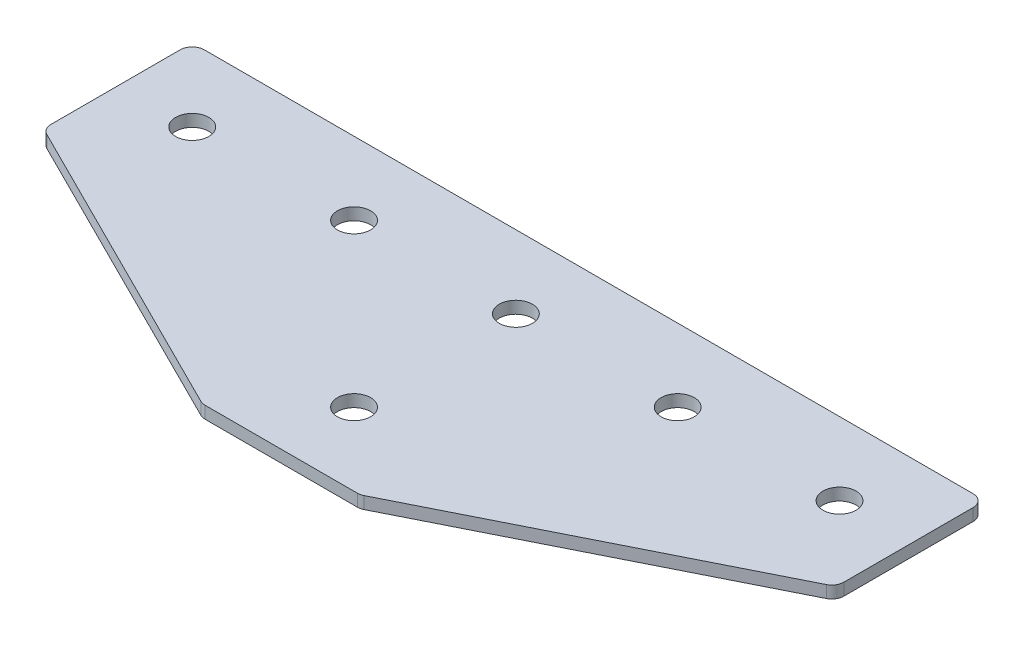
ISO-10303-21;
HEADER;
FILE_DESCRIPTION(('STEP AP214'),'2;1');
FILE_NAME('part.step','',(''),(''),'','','');
FILE_SCHEMA(('AUTOMOTIVE_DESIGN { 1 0 10303 214 1 1 1 1 }'));
ENDSEC;
DATA;
#1=APPLICATION_CONTEXT('core data for automotive mechanical design processes');
#2=APPLICATION_PROTOCOL_DEFINITION('international standard','automotive_design',2000,#1);
#3=PRODUCT_CONTEXT('',#1,'mechanical');
#4=PRODUCT('Part','Part','',(#3));
#5=PRODUCT_RELATED_PRODUCT_CATEGORY('part','',(#4));
#6=PRODUCT_DEFINITION_FORMATION('','',#4);
#7=PRODUCT_DEFINITION_CONTEXT('part definition',#1,'design');
#8=PRODUCT_DEFINITION('design','',#6,#7);
#9=PRODUCT_DEFINITION_SHAPE('','',#8);
#10=(LENGTH_UNIT() NAMED_UNIT(*) SI_UNIT(.MILLI.,.METRE.));
#11=(NAMED_UNIT(*) PLANE_ANGLE_UNIT() SI_UNIT($,.RADIAN.));
#12=(NAMED_UNIT(*) SI_UNIT($,.STERADIAN.) SOLID_ANGLE_UNIT());
#13=UNCERTAINTY_MEASURE_WITH_UNIT(LENGTH_MEASURE(1.E-05),#10,'distance_accuracy_value','');
#14=(GEOMETRIC_REPRESENTATION_CONTEXT(3) GLOBAL_UNCERTAINTY_ASSIGNED_CONTEXT((#13)) GLOBAL_UNIT_ASSIGNED_CONTEXT((#10,
#11,#12)) REPRESENTATION_CONTEXT('',''));
#15=CARTESIAN_POINT('',(0.,0.,0.));
#16=DIRECTION('',(0.,0.,1.));
#17=DIRECTION('',(1.,0.,0.));
#18=AXIS2_PLACEMENT_3D('',#15,#16,#17);
#19=CARTESIAN_POINT('',(-1.37420990733972,1.42462627720624,-21.5499410746997));
#20=DIRECTION('',(0.,-1.,0.));
#21=DIRECTION('',(0.,0.,-1.));
#22=AXIS2_PLACEMENT_3D('',#19,#20,#21);
#23=PLANE('',#22);
#24=CARTESIAN_POINT('',(-1.37420990733972,1.42462627720624,-21.5499410746997));
#25=DIRECTION('',(0.,1.,0.));
#26=DIRECTION('',(0.,0.,1.));
#27=AXIS2_PLACEMENT_3D('',#24,#25,#26);
#28=CIRCLE('',#27,4.1);
#29=CARTESIAN_POINT('',(-1.37420990733972,1.42462627720624,-17.4499410746997));
#30=VERTEX_POINT('',#29);
#31=EDGE_CURVE('E119',#30,#30,#28,.T.);
#32=ORIENTED_EDGE('',*,*,#31,.T.);
#33=EDGE_LOOP('',(#32));
#34=FACE_BOUND('',#33,.T.);
#35=DIRECTION('',(1.,0.,0.));
#36=VECTOR('',#35,1.);
#37=CARTESIAN_POINT('',(-19.3742099073397,1.42462627720624,36.4500589253003));
#38=LINE('',#37,#36);
#39=CARTESIAN_POINT('',(-20.1938700198407,1.42462627720624,36.4500589253003));
#40=VERTEX_POINT('',#39);
#41=CARTESIAN_POINT('',(17.4454502051613,1.42462627720624,36.4500589253003));
#42=VERTEX_POINT('',#41);
#43=EDGE_CURVE('E164',#40,#42,#38,.T.);
#44=ORIENTED_EDGE('',*,*,#43,.F.);
#45=CARTESIAN_POINT('',(-20.1938700198407,1.42462627720624,33.4500589253003));
#46=DIRECTION('',(0.,1.,0.));
#47=DIRECTION('',(0.,0.,-1.));
#48=AXIS2_PLACEMENT_3D('',#45,#46,#47);
#49=CIRCLE('',#48,3.);
#50=CARTESIAN_POINT('',(-21.5355108063406,1.42462627720624,36.1333404983));
#51=VERTEX_POINT('',#50);
#52=EDGE_CURVE('E221',#51,#40,#49,.T.);
#53=ORIENTED_EDGE('',*,*,#52,.F.);
#54=DIRECTION('',(-0.894427190999916,0.,-0.447213595499958));
#55=VECTOR('',#54,1.);
#56=CARTESIAN_POINT('',(-20.9020739523401,1.42462627720624,36.4500589253003));
#57=LINE('',#56,#55);
#58=CARTESIAN_POINT('',(-97.7158506938396,1.42462627720624,-1.95682944544947));
#59=VERTEX_POINT('',#58);
#60=EDGE_CURVE('E224',#51,#59,#57,.T.);
#61=ORIENTED_EDGE('',*,*,#60,.T.);
#62=CARTESIAN_POINT('',(-96.3742099073397,1.42462627720624,-4.64011101844922));
#63=DIRECTION('',(0.,1.,0.));
#64=DIRECTION('',(0.,0.,-1.));
#65=AXIS2_PLACEMENT_3D('',#62,#63,#64);
#66=CIRCLE('',#65,3.);
#67=CARTESIAN_POINT('',(-99.3742099073397,1.42462627720624,-4.64011101844922));
#68=VERTEX_POINT('',#67);
#69=EDGE_CURVE('E227',#68,#59,#66,.T.);
#70=ORIENTED_EDGE('',*,*,#69,.F.);
#71=DIRECTION('',(0.,0.,-1.));
#72=VECTOR('',#71,1.);
#73=CARTESIAN_POINT('',(-99.3742099073397,1.42462627720624,-2.78600905219954));
#74=LINE('',#73,#72);
#75=CARTESIAN_POINT('',(-99.3742099073397,1.42462627720624,-36.5499410746998));
#76=VERTEX_POINT('',#75);
#77=EDGE_CURVE('E130',#68,#76,#74,.T.);
#78=ORIENTED_EDGE('',*,*,#77,.T.);
#79=CARTESIAN_POINT('',(-96.3742099073397,1.42462627720624,-36.5499410746998));
#80=DIRECTION('',(0.,1.,0.));
#81=DIRECTION('',(0.,0.,-1.));
#82=AXIS2_PLACEMENT_3D('',#79,#80,#81);
#83=CIRCLE('',#82,3.);
#84=CARTESIAN_POINT('',(-96.3742099073397,1.42462627720624,-39.5499410746998));
#85=VERTEX_POINT('',#84);
#86=EDGE_CURVE('E233',#85,#76,#83,.T.);
#87=ORIENTED_EDGE('',*,*,#86,.F.);
#88=DIRECTION('',(-1.,0.,0.));
#89=VECTOR('',#88,1.);
#90=CARTESIAN_POINT('',(96.6257900926603,1.42462627720624,-39.5499410746998));
#91=LINE('',#90,#89);
#92=CARTESIAN_POINT('',(93.6257900926603,1.42462627720624,-39.5499410746998));
#93=VERTEX_POINT('',#92);
#94=EDGE_CURVE('E134',#93,#85,#91,.T.);
#95=ORIENTED_EDGE('',*,*,#94,.F.);
#96=CARTESIAN_POINT('',(93.6257900926603,1.42462627720624,-36.5499410746998));
#97=DIRECTION('',(0.,-1.,0.));
#98=DIRECTION('',(0.,0.,-1.));
#99=AXIS2_PLACEMENT_3D('',#96,#97,#98);
#100=CIRCLE('',#99,3.);
#101=CARTESIAN_POINT('',(96.6257900926603,1.42462627720624,-36.5499410746998));
#102=VERTEX_POINT('',#101);
#103=EDGE_CURVE('E185',#93,#102,#100,.T.);
#104=ORIENTED_EDGE('',*,*,#103,.T.);
#105=DIRECTION('',(0.,0.,-1.));
#106=VECTOR('',#105,1.);
#107=CARTESIAN_POINT('',(96.6257900926603,1.42462627720624,-2.78600905219954));
#108=LINE('',#107,#106);
#109=CARTESIAN_POINT('',(96.6257900926603,1.42462627720624,-4.64011101844922));
#110=VERTEX_POINT('',#109);
#111=EDGE_CURVE('E169',#110,#102,#108,.T.);
#112=ORIENTED_EDGE('',*,*,#111,.F.);
#113=CARTESIAN_POINT('',(93.6257900926603,1.42462627720624,-4.64011101844922));
#114=DIRECTION('',(0.,-1.,0.));
#115=DIRECTION('',(0.,0.,-1.));
#116=AXIS2_PLACEMENT_3D('',#113,#114,#115);
#117=CIRCLE('',#116,3.);
#118=CARTESIAN_POINT('',(94.9674308791601,1.42462627720624,-1.95682944544947));
#119=VERTEX_POINT('',#118);
#120=EDGE_CURVE('E31',#110,#119,#117,.T.);
#121=ORIENTED_EDGE('',*,*,#120,.T.);
#122=DIRECTION('',(0.894427190999916,0.,-0.447213595499958));
#123=VECTOR('',#122,1.);
#124=CARTESIAN_POINT('',(18.1536541376607,1.42462627720624,36.4500589253003));
#125=LINE('',#124,#123);
#126=CARTESIAN_POINT('',(18.7870909916612,1.42462627720624,36.1333404983));
#127=VERTEX_POINT('',#126);
#128=EDGE_CURVE('E167',#127,#119,#125,.T.);
#129=ORIENTED_EDGE('',*,*,#128,.F.);
#130=CARTESIAN_POINT('',(17.4454502051613,1.42462627720624,33.4500589253003));
#131=DIRECTION('',(0.,-1.,0.));
#132=DIRECTION('',(0.,0.,-1.));
#133=AXIS2_PLACEMENT_3D('',#130,#131,#132);
#134=CIRCLE('',#133,3.);
#135=EDGE_CURVE('E188',#127,#42,#134,.T.);
#136=ORIENTED_EDGE('',*,*,#135,.T.);
#137=EDGE_LOOP('',(#44,#53,#61,#70,#78,#87,#95,#104,#112,#121,#129,#136));
#138=FACE_BOUND('',#137,.T.);
#139=CARTESIAN_POINT('',(-1.37420990733973,1.42462627720624,18.4500589253003));
#140=DIRECTION('',(0.,1.,0.));
#141=DIRECTION('',(0.,0.,1.));
#142=AXIS2_PLACEMENT_3D('',#139,#140,#141);
#143=CIRCLE('',#142,4.1);
#144=CARTESIAN_POINT('',(-1.37420990733973,1.42462627720624,22.5500589253003));
#145=VERTEX_POINT('',#144);
#146=EDGE_CURVE('E147',#145,#145,#143,.T.);
#147=ORIENTED_EDGE('',*,*,#146,.T.);
#148=EDGE_LOOP('',(#147));
#149=FACE_BOUND('',#148,.T.);
#150=CARTESIAN_POINT('',(78.6257900926603,1.42462627720624,-21.5499410746997));
#151=DIRECTION('',(0.,1.,0.));
#152=DIRECTION('',(0.,0.,1.));
#153=AXIS2_PLACEMENT_3D('',#150,#151,#152);
#154=CIRCLE('',#153,4.1);
#155=CARTESIAN_POINT('',(78.6257900926603,1.42462627720624,-17.4499410746997));
#156=VERTEX_POINT('',#155);
#157=EDGE_CURVE('E139',#156,#156,#154,.T.);
#158=ORIENTED_EDGE('',*,*,#157,.T.);
#159=EDGE_LOOP('',(#158));
#160=FACE_BOUND('',#159,.T.);
#161=CARTESIAN_POINT('',(38.6257900926603,1.42462627720624,-21.5499410746997));
#162=DIRECTION('',(0.,1.,0.));
#163=DIRECTION('',(0.,0.,1.));
#164=AXIS2_PLACEMENT_3D('',#161,#162,#163);
#165=CIRCLE('',#164,4.1);
#166=CARTESIAN_POINT('',(38.6257900926603,1.42462627720624,-17.4499410746997));
#167=VERTEX_POINT('',#166);
#168=EDGE_CURVE('E153',#167,#167,#165,.T.);
#169=ORIENTED_EDGE('',*,*,#168,.T.);
#170=EDGE_LOOP('',(#169));
#171=FACE_BOUND('',#170,.T.);
#172=CARTESIAN_POINT('',(-81.3742099073397,1.42462627720624,-21.5499410746997));
#173=DIRECTION('',(0.,-1.,0.));
#174=DIRECTION('',(0.,0.,1.));
#175=AXIS2_PLACEMENT_3D('',#172,#173,#174);
#176=CIRCLE('',#175,4.1);
#177=CARTESIAN_POINT('',(-81.3742099073397,1.42462627720624,-17.4499410746997));
#178=VERTEX_POINT('',#177);
#179=EDGE_CURVE('E423',#178,#178,#176,.T.);
#180=ORIENTED_EDGE('',*,*,#179,.F.);
#181=EDGE_LOOP('',(#180));
#182=FACE_BOUND('',#181,.T.);
#183=CARTESIAN_POINT('',(-41.3742099073397,1.42462627720624,-21.5499410746997));
#184=DIRECTION('',(0.,-1.,0.));
#185=DIRECTION('',(0.,0.,1.));
#186=AXIS2_PLACEMENT_3D('',#183,#184,#185);
#187=CIRCLE('',#186,4.1);
#188=CARTESIAN_POINT('',(-41.3742099073397,1.42462627720624,-17.4499410746997));
#189=VERTEX_POINT('',#188);
#190=EDGE_CURVE('E254',#189,#189,#187,.T.);
#191=ORIENTED_EDGE('',*,*,#190,.F.);
#192=EDGE_LOOP('',(#191));
#193=FACE_BOUND('',#192,.T.);
#194=ADVANCED_FACE('F16',(#34,#138,#149,#160,#171,#182,#193),#23,.T.);
#195=CARTESIAN_POINT('',(96.6257900926603,1.42462627720624,-39.5499410746998));
#196=DIRECTION('',(0.,0.,-1.));
#197=DIRECTION('',(-1.,0.,0.));
#198=AXIS2_PLACEMENT_3D('',#195,#196,#197);
#199=PLANE('',#198);
#200=ORIENTED_EDGE('',*,*,#94,.T.);
#201=DIRECTION('',(0.,1.,0.));
#202=VECTOR('',#201,1.);
#203=CARTESIAN_POINT('',(-96.3742099073397,1.42462627720624,-39.5499410746998));
#204=LINE('',#203,#202);
#205=CARTESIAN_POINT('',(-96.3742099073397,4.42462627720624,-39.5499410746998));
#206=VERTEX_POINT('',#205);
#207=EDGE_CURVE('E125',#206,#85,#204,.F.);
#208=ORIENTED_EDGE('',*,*,#207,.F.);
#209=DIRECTION('',(-1.,0.,0.));
#210=VECTOR('',#209,1.);
#211=CARTESIAN_POINT('',(96.6257900926603,4.42462627720624,-39.5499410746998));
#212=LINE('',#211,#210);
#213=CARTESIAN_POINT('',(93.6257900926603,4.42462627720624,-39.5499410746998));
#214=VERTEX_POINT('',#213);
#215=EDGE_CURVE('E105',#214,#206,#212,.T.);
#216=ORIENTED_EDGE('',*,*,#215,.F.);
#217=DIRECTION('',(0.,1.,0.));
#218=VECTOR('',#217,1.);
#219=CARTESIAN_POINT('',(93.6257900926603,1.42462627720624,-39.5499410746998));
#220=LINE('',#219,#218);
#221=EDGE_CURVE('E10',#214,#93,#220,.F.);
#222=ORIENTED_EDGE('',*,*,#221,.T.);
#223=EDGE_LOOP('',(#200,#208,#216,#222));
#224=FACE_BOUND('',#223,.T.);
#225=ADVANCED_FACE('F132',(#224),#199,.T.);
#226=CARTESIAN_POINT('',(96.6257900926603,1.42462627720624,-2.78600905219954));
#227=DIRECTION('',(1.,0.,0.));
#228=DIRECTION('',(0.,0.,-1.));
#229=AXIS2_PLACEMENT_3D('',#226,#227,#228);
#230=PLANE('',#229);
#231=DIRECTION('',(0.,0.,-1.));
#232=VECTOR('',#231,1.);
#233=CARTESIAN_POINT('',(96.6257900926603,4.42462627720624,-2.78600905219954));
#234=LINE('',#233,#232);
#235=CARTESIAN_POINT('',(96.6257900926603,4.42462627720624,-4.64011101844922));
#236=VERTEX_POINT('',#235);
#237=CARTESIAN_POINT('',(96.6257900926603,4.42462627720624,-36.5499410746998));
#238=VERTEX_POINT('',#237);
#239=EDGE_CURVE('E165',#236,#238,#234,.T.);
#240=ORIENTED_EDGE('',*,*,#239,.F.);
#241=DIRECTION('',(0.,1.,0.));
#242=VECTOR('',#241,1.);
#243=CARTESIAN_POINT('',(96.6257900926603,1.42462627720624,-4.64011101844922));
#244=LINE('',#243,#242);
#245=EDGE_CURVE('E24',#236,#110,#244,.F.);
#246=ORIENTED_EDGE('',*,*,#245,.T.);
#247=ORIENTED_EDGE('',*,*,#111,.T.);
#248=DIRECTION('',(0.,1.,0.));
#249=VECTOR('',#248,1.);
#250=CARTESIAN_POINT('',(96.6257900926603,1.42462627720624,-36.5499410746998));
#251=LINE('',#250,#249);
#252=EDGE_CURVE('E195',#102,#238,#251,.T.);
#253=ORIENTED_EDGE('',*,*,#252,.T.);
#254=EDGE_LOOP('',(#240,#246,#247,#253));
#255=FACE_BOUND('',#254,.T.);
#256=ADVANCED_FACE('F200',(#255),#230,.T.);
#257=CARTESIAN_POINT('',(18.1536541376607,1.42462627720624,36.4500589253003));
#258=DIRECTION('',(0.447213595499958,0.,0.894427190999916));
#259=DIRECTION('',(0.894427190999916,0.,-0.447213595499958));
#260=AXIS2_PLACEMENT_3D('',#257,#258,#259);
#261=PLANE('',#260);
#262=DIRECTION('',(0.894427190999916,0.,-0.447213595499958));
#263=VECTOR('',#262,1.);
#264=CARTESIAN_POINT('',(18.1536541376607,4.42462627720624,36.4500589253003));
#265=LINE('',#264,#263);
#266=CARTESIAN_POINT('',(18.7870909916612,4.42462627720624,36.1333404983));
#267=VERTEX_POINT('',#266);
#268=CARTESIAN_POINT('',(94.9674308791601,4.42462627720624,-1.95682944544947));
#269=VERTEX_POINT('',#268);
#270=EDGE_CURVE('E173',#267,#269,#265,.T.);
#271=ORIENTED_EDGE('',*,*,#270,.F.);
#272=DIRECTION('',(0.,1.,0.));
#273=VECTOR('',#272,1.);
#274=CARTESIAN_POINT('',(18.7870909916612,1.42462627720624,36.1333404983));
#275=LINE('',#274,#273);
#276=EDGE_CURVE('E38',#267,#127,#275,.F.);
#277=ORIENTED_EDGE('',*,*,#276,.T.);
#278=ORIENTED_EDGE('',*,*,#128,.T.);
#279=DIRECTION('',(0.,1.,0.));
#280=VECTOR('',#279,1.);
#281=CARTESIAN_POINT('',(94.9674308791602,1.42462627720624,-1.95682944544948));
#282=LINE('',#281,#280);
#283=EDGE_CURVE('E191',#119,#269,#282,.T.);
#284=ORIENTED_EDGE('',*,*,#283,.T.);
#285=EDGE_LOOP('',(#271,#277,#278,#284));
#286=FACE_BOUND('',#285,.T.);
#287=ADVANCED_FACE('F207',(#286),#261,.T.);
#288=CARTESIAN_POINT('',(-19.3742099073397,1.42462627720624,36.4500589253003));
#289=DIRECTION('',(0.,0.,1.));
#290=DIRECTION('',(1.,0.,0.));
#291=AXIS2_PLACEMENT_3D('',#288,#289,#290);
#292=PLANE('',#291);
#293=DIRECTION('',(1.,0.,0.));
#294=VECTOR('',#293,1.);
#295=CARTESIAN_POINT('',(-19.3742099073397,4.42462627720624,36.4500589253003));
#296=LINE('',#295,#294);
#297=CARTESIAN_POINT('',(-20.1938700198407,4.42462627720624,36.4500589253003));
#298=VERTEX_POINT('',#297);
#299=CARTESIAN_POINT('',(17.4454502051613,4.42462627720624,36.4500589253003));
#300=VERTEX_POINT('',#299);
#301=EDGE_CURVE('E118',#298,#300,#296,.T.);
#302=ORIENTED_EDGE('',*,*,#301,.F.);
#303=DIRECTION('',(0.,1.,0.));
#304=VECTOR('',#303,1.);
#305=CARTESIAN_POINT('',(-20.1938700198407,1.42462627720624,36.4500589253003));
#306=LINE('',#305,#304);
#307=EDGE_CURVE('E217',#40,#298,#306,.T.);
#308=ORIENTED_EDGE('',*,*,#307,.F.);
#309=ORIENTED_EDGE('',*,*,#43,.T.);
#310=DIRECTION('',(0.,1.,0.));
#311=VECTOR('',#310,1.);
#312=CARTESIAN_POINT('',(17.4454502051613,1.42462627720624,36.4500589253003));
#313=LINE('',#312,#311);
#314=EDGE_CURVE('E182',#42,#300,#313,.T.);
#315=ORIENTED_EDGE('',*,*,#314,.T.);
#316=EDGE_LOOP('',(#302,#308,#309,#315));
#317=FACE_BOUND('',#316,.T.);
#318=ADVANCED_FACE('F214',(#317),#292,.T.);
#319=CARTESIAN_POINT('',(-1.37420990733972,4.42462627720624,-21.5499410746997));
#320=DIRECTION('',(0.,-1.,0.));
#321=DIRECTION('',(0.,0.,-1.));
#322=AXIS2_PLACEMENT_3D('',#319,#320,#321);
#323=PLANE('',#322);
#324=CARTESIAN_POINT('',(-1.37420990733972,4.42462627720624,-21.5499410746997));
#325=DIRECTION('',(0.,1.,0.));
#326=DIRECTION('',(0.,0.,1.));
#327=AXIS2_PLACEMENT_3D('',#324,#325,#326);
#328=CIRCLE('',#327,4.1);
#329=CARTESIAN_POINT('',(-1.37420990733972,4.42462627720624,-17.4499410746997));
#330=VERTEX_POINT('',#329);
#331=EDGE_CURVE('E156',#330,#330,#328,.T.);
#332=ORIENTED_EDGE('',*,*,#331,.F.);
#333=EDGE_LOOP('',(#332));
#334=FACE_BOUND('',#333,.T.);
#335=CARTESIAN_POINT('',(-20.1938700198407,4.42462627720624,33.4500589253003));
#336=DIRECTION('',(0.,1.,0.));
#337=DIRECTION('',(0.,0.,-1.));
#338=AXIS2_PLACEMENT_3D('',#335,#336,#337);
#339=CIRCLE('',#338,3.);
#340=CARTESIAN_POINT('',(-21.5355108063406,4.42462627720624,36.1333404983));
#341=VERTEX_POINT('',#340);
#342=EDGE_CURVE('E239',#298,#341,#339,.F.);
#343=ORIENTED_EDGE('',*,*,#342,.F.);
#344=ORIENTED_EDGE('',*,*,#301,.T.);
#345=CARTESIAN_POINT('',(17.4454502051613,4.42462627720624,33.4500589253003));
#346=DIRECTION('',(0.,-1.,0.));
#347=DIRECTION('',(0.,0.,-1.));
#348=AXIS2_PLACEMENT_3D('',#345,#346,#347);
#349=CIRCLE('',#348,3.);
#350=EDGE_CURVE('E180',#300,#267,#349,.F.);
#351=ORIENTED_EDGE('',*,*,#350,.T.);
#352=ORIENTED_EDGE('',*,*,#270,.T.);
#353=CARTESIAN_POINT('',(93.6257900926603,4.42462627720624,-4.64011101844922));
#354=DIRECTION('',(0.,-1.,0.));
#355=DIRECTION('',(0.,0.,-1.));
#356=AXIS2_PLACEMENT_3D('',#353,#354,#355);
#357=CIRCLE('',#356,3.);
#358=EDGE_CURVE('E178',#269,#236,#357,.F.);
#359=ORIENTED_EDGE('',*,*,#358,.T.);
#360=ORIENTED_EDGE('',*,*,#239,.T.);
#361=CARTESIAN_POINT('',(93.6257900926603,4.42462627720624,-36.5499410746998));
#362=DIRECTION('',(0.,-1.,0.));
#363=DIRECTION('',(0.,0.,-1.));
#364=AXIS2_PLACEMENT_3D('',#361,#362,#363);
#365=CIRCLE('',#364,3.);
#366=EDGE_CURVE('E114',#238,#214,#365,.F.);
#367=ORIENTED_EDGE('',*,*,#366,.T.);
#368=ORIENTED_EDGE('',*,*,#215,.T.);
#369=CARTESIAN_POINT('',(-96.3742099073397,4.42462627720624,-36.5499410746998));
#370=DIRECTION('',(0.,1.,0.));
#371=DIRECTION('',(0.,0.,-1.));
#372=AXIS2_PLACEMENT_3D('',#369,#370,#371);
#373=CIRCLE('',#372,3.);
#374=CARTESIAN_POINT('',(-99.3742099073397,4.42462627720624,-36.5499410746998));
#375=VERTEX_POINT('',#374);
#376=EDGE_CURVE('E111',#375,#206,#373,.F.);
#377=ORIENTED_EDGE('',*,*,#376,.F.);
#378=DIRECTION('',(0.,0.,-1.));
#379=VECTOR('',#378,1.);
#380=CARTESIAN_POINT('',(-99.3742099073397,4.42462627720624,-2.78600905219954));
#381=LINE('',#380,#379);
#382=CARTESIAN_POINT('',(-99.3742099073397,4.42462627720624,-4.64011101844922));
#383=VERTEX_POINT('',#382);
#384=EDGE_CURVE('E244',#383,#375,#381,.T.);
#385=ORIENTED_EDGE('',*,*,#384,.F.);
#386=CARTESIAN_POINT('',(-96.3742099073397,4.42462627720624,-4.64011101844922));
#387=DIRECTION('',(0.,1.,0.));
#388=DIRECTION('',(0.,0.,-1.));
#389=AXIS2_PLACEMENT_3D('',#386,#387,#388);
#390=CIRCLE('',#389,3.);
#391=CARTESIAN_POINT('',(-97.7158506938396,4.42462627720624,-1.95682944544947));
#392=VERTEX_POINT('',#391);
#393=EDGE_CURVE('E129',#392,#383,#390,.F.);
#394=ORIENTED_EDGE('',*,*,#393,.F.);
#395=DIRECTION('',(-0.894427190999916,0.,-0.447213595499958));
#396=VECTOR('',#395,1.);
#397=CARTESIAN_POINT('',(-20.9020739523401,4.42462627720624,36.4500589253003));
#398=LINE('',#397,#396);
#399=EDGE_CURVE('E248',#341,#392,#398,.T.);
#400=ORIENTED_EDGE('',*,*,#399,.F.);
#401=EDGE_LOOP('',(#343,#344,#351,#352,#359,#360,#367,#368,#377,#385,#394,#400));
#402=FACE_BOUND('',#401,.T.);
#403=CARTESIAN_POINT('',(78.6257900926603,4.42462627720624,-21.5499410746997));
#404=DIRECTION('',(0.,1.,0.));
#405=DIRECTION('',(0.,0.,1.));
#406=AXIS2_PLACEMENT_3D('',#403,#404,#405);
#407=CIRCLE('',#406,4.1);
#408=CARTESIAN_POINT('',(78.6257900926603,4.42462627720624,-17.4499410746997));
#409=VERTEX_POINT('',#408);
#410=EDGE_CURVE('E135',#409,#409,#407,.T.);
#411=ORIENTED_EDGE('',*,*,#410,.F.);
#412=EDGE_LOOP('',(#411));
#413=FACE_BOUND('',#412,.T.);
#414=CARTESIAN_POINT('',(38.6257900926603,4.42462627720624,-21.5499410746997));
#415=DIRECTION('',(0.,1.,0.));
#416=DIRECTION('',(0.,0.,1.));
#417=AXIS2_PLACEMENT_3D('',#414,#415,#416);
#418=CIRCLE('',#417,4.1);
#419=CARTESIAN_POINT('',(38.6257900926603,4.42462627720624,-17.4499410746997));
#420=VERTEX_POINT('',#419);
#421=EDGE_CURVE('E150',#420,#420,#418,.T.);
#422=ORIENTED_EDGE('',*,*,#421,.F.);
#423=EDGE_LOOP('',(#422));
#424=FACE_BOUND('',#423,.T.);
#425=CARTESIAN_POINT('',(-1.37420990733973,4.42462627720624,18.4500589253003));
#426=DIRECTION('',(0.,1.,0.));
#427=DIRECTION('',(0.,0.,1.));
#428=AXIS2_PLACEMENT_3D('',#425,#426,#427);
#429=CIRCLE('',#428,4.1);
#430=CARTESIAN_POINT('',(-1.37420990733973,4.42462627720624,22.5500589253003));
#431=VERTEX_POINT('',#430);
#432=EDGE_CURVE('E145',#431,#431,#429,.T.);
#433=ORIENTED_EDGE('',*,*,#432,.F.);
#434=EDGE_LOOP('',(#433));
#435=FACE_BOUND('',#434,.T.);
#436=CARTESIAN_POINT('',(-81.3742099073397,4.42462627720624,-21.5499410746997));
#437=DIRECTION('',(0.,-1.,0.));
#438=DIRECTION('',(0.,0.,1.));
#439=AXIS2_PLACEMENT_3D('',#436,#437,#438);
#440=CIRCLE('',#439,4.1);
#441=CARTESIAN_POINT('',(-81.3742099073397,4.42462627720624,-17.4499410746997));
#442=VERTEX_POINT('',#441);
#443=EDGE_CURVE('E426',#442,#442,#440,.T.);
#444=ORIENTED_EDGE('',*,*,#443,.T.);
#445=EDGE_LOOP('',(#444));
#446=FACE_BOUND('',#445,.T.);
#447=CARTESIAN_POINT('',(-41.3742099073397,4.42462627720624,-21.5499410746997));
#448=DIRECTION('',(0.,-1.,0.));
#449=DIRECTION('',(0.,0.,1.));
#450=AXIS2_PLACEMENT_3D('',#447,#448,#449);
#451=CIRCLE('',#450,4.1);
#452=CARTESIAN_POINT('',(-41.3742099073397,4.42462627720624,-17.4499410746997));
#453=VERTEX_POINT('',#452);
#454=EDGE_CURVE('E251',#453,#453,#451,.T.);
#455=ORIENTED_EDGE('',*,*,#454,.T.);
#456=EDGE_LOOP('',(#455));
#457=FACE_BOUND('',#456,.T.);
#458=ADVANCED_FACE('F108',(#334,#402,#413,#424,#435,#446,#457),#323,.F.);
#459=CARTESIAN_POINT('',(17.4454502051613,1.42462627720624,33.4500589253003));
#460=DIRECTION('',(0.,1.,0.));
#461=DIRECTION('',(0.,0.,1.));
#462=AXIS2_PLACEMENT_3D('',#459,#460,#461);
#463=CYLINDRICAL_SURFACE('',#462,3.);
#464=ORIENTED_EDGE('',*,*,#135,.F.);
#465=ORIENTED_EDGE('',*,*,#276,.F.);
#466=ORIENTED_EDGE('',*,*,#350,.F.);
#467=ORIENTED_EDGE('',*,*,#314,.F.);
#468=EDGE_LOOP('',(#464,#465,#466,#467));
#469=FACE_BOUND('',#468,.T.);
#470=ADVANCED_FACE('F212',(#469),#463,.T.);
#471=CARTESIAN_POINT('',(93.6257900926603,1.42462627720624,-4.64011101844922));
#472=DIRECTION('',(0.,1.,0.));
#473=DIRECTION('',(0.,0.,1.));
#474=AXIS2_PLACEMENT_3D('',#471,#472,#473);
#475=CYLINDRICAL_SURFACE('',#474,3.);
#476=ORIENTED_EDGE('',*,*,#120,.F.);
#477=ORIENTED_EDGE('',*,*,#245,.F.);
#478=ORIENTED_EDGE('',*,*,#358,.F.);
#479=ORIENTED_EDGE('',*,*,#283,.F.);
#480=EDGE_LOOP('',(#476,#477,#478,#479));
#481=FACE_BOUND('',#480,.T.);
#482=ADVANCED_FACE('F206',(#481),#475,.T.);
#483=CARTESIAN_POINT('',(93.6257900926603,1.42462627720624,-36.5499410746998));
#484=DIRECTION('',(0.,1.,0.));
#485=DIRECTION('',(0.,0.,1.));
#486=AXIS2_PLACEMENT_3D('',#483,#484,#485);
#487=CYLINDRICAL_SURFACE('',#486,3.);
#488=ORIENTED_EDGE('',*,*,#103,.F.);
#489=ORIENTED_EDGE('',*,*,#221,.F.);
#490=ORIENTED_EDGE('',*,*,#366,.F.);
#491=ORIENTED_EDGE('',*,*,#252,.F.);
#492=EDGE_LOOP('',(#488,#489,#490,#491));
#493=FACE_BOUND('',#492,.T.);
#494=ADVANCED_FACE('F18',(#493),#487,.T.);
#495=CARTESIAN_POINT('',(-1.37420990733972,1.42462627720624,-21.5499410746997));
#496=DIRECTION('',(0.,1.,0.));
#497=DIRECTION('',(0.,0.,1.));
#498=AXIS2_PLACEMENT_3D('',#495,#496,#497);
#499=CYLINDRICAL_SURFACE('',#498,4.1);
#500=ORIENTED_EDGE('',*,*,#31,.F.);
#501=EDGE_LOOP('',(#500));
#502=FACE_BOUND('',#501,.T.);
#503=ORIENTED_EDGE('',*,*,#331,.T.);
#504=EDGE_LOOP('',(#503));
#505=FACE_BOUND('',#504,.T.);
#506=ADVANCED_FACE('F288',(#502,#505),#499,.F.);
#507=CARTESIAN_POINT('',(38.6257900926603,1.42462627720624,-21.5499410746997));
#508=DIRECTION('',(0.,1.,0.));
#509=DIRECTION('',(0.,0.,1.));
#510=AXIS2_PLACEMENT_3D('',#507,#508,#509);
#511=CYLINDRICAL_SURFACE('',#510,4.1);
#512=ORIENTED_EDGE('',*,*,#168,.F.);
#513=EDGE_LOOP('',(#512));
#514=FACE_BOUND('',#513,.T.);
#515=ORIENTED_EDGE('',*,*,#421,.T.);
#516=EDGE_LOOP('',(#515));
#517=FACE_BOUND('',#516,.T.);
#518=ADVANCED_FACE('F293',(#514,#517),#511,.F.);
#519=CARTESIAN_POINT('',(-1.37420990733973,1.42462627720624,18.4500589253003));
#520=DIRECTION('',(0.,1.,0.));
#521=DIRECTION('',(0.,0.,1.));
#522=AXIS2_PLACEMENT_3D('',#519,#520,#521);
#523=CYLINDRICAL_SURFACE('',#522,4.1);
#524=ORIENTED_EDGE('',*,*,#432,.T.);
#525=EDGE_LOOP('',(#524));
#526=FACE_BOUND('',#525,.T.);
#527=ORIENTED_EDGE('',*,*,#146,.F.);
#528=EDGE_LOOP('',(#527));
#529=FACE_BOUND('',#528,.T.);
#530=ADVANCED_FACE('F299',(#526,#529),#523,.F.);
#531=CARTESIAN_POINT('',(78.6257900926603,1.42462627720624,-21.5499410746997));
#532=DIRECTION('',(0.,1.,0.));
#533=DIRECTION('',(0.,0.,1.));
#534=AXIS2_PLACEMENT_3D('',#531,#532,#533);
#535=CYLINDRICAL_SURFACE('',#534,4.1);
#536=ORIENTED_EDGE('',*,*,#157,.F.);
#537=EDGE_LOOP('',(#536));
#538=FACE_BOUND('',#537,.T.);
#539=ORIENTED_EDGE('',*,*,#410,.T.);
#540=EDGE_LOOP('',(#539));
#541=FACE_BOUND('',#540,.T.);
#542=ADVANCED_FACE('F354',(#538,#541),#535,.F.);
#543=CARTESIAN_POINT('',(-99.3742099073397,1.42462627720624,-2.78600905219954));
#544=DIRECTION('',(-1.,0.,0.));
#545=DIRECTION('',(0.,0.,-1.));
#546=AXIS2_PLACEMENT_3D('',#543,#544,#545);
#547=PLANE('',#546);
#548=ORIENTED_EDGE('',*,*,#384,.T.);
#549=DIRECTION('',(0.,1.,0.));
#550=VECTOR('',#549,1.);
#551=CARTESIAN_POINT('',(-99.3742099073397,1.42462627720624,-36.5499410746998));
#552=LINE('',#551,#550);
#553=EDGE_CURVE('E127',#76,#375,#552,.T.);
#554=ORIENTED_EDGE('',*,*,#553,.F.);
#555=ORIENTED_EDGE('',*,*,#77,.F.);
#556=DIRECTION('',(0.,1.,0.));
#557=VECTOR('',#556,1.);
#558=CARTESIAN_POINT('',(-99.3742099073397,1.42462627720624,-4.64011101844922));
#559=LINE('',#558,#557);
#560=EDGE_CURVE('E136',#383,#68,#559,.F.);
#561=ORIENTED_EDGE('',*,*,#560,.F.);
#562=EDGE_LOOP('',(#548,#554,#555,#561));
#563=FACE_BOUND('',#562,.T.);
#564=ADVANCED_FACE('F261',(#563),#547,.T.);
#565=CARTESIAN_POINT('',(-20.9020739523401,1.42462627720624,36.4500589253003));
#566=DIRECTION('',(-0.447213595499958,0.,0.894427190999916));
#567=DIRECTION('',(-0.894427190999916,0.,-0.447213595499958));
#568=AXIS2_PLACEMENT_3D('',#565,#566,#567);
#569=PLANE('',#568);
#570=ORIENTED_EDGE('',*,*,#399,.T.);
#571=DIRECTION('',(0.,1.,0.));
#572=VECTOR('',#571,1.);
#573=CARTESIAN_POINT('',(-97.7158506938396,1.42462627720624,-1.95682944544948));
#574=LINE('',#573,#572);
#575=EDGE_CURVE('E226',#59,#392,#574,.T.);
#576=ORIENTED_EDGE('',*,*,#575,.F.);
#577=ORIENTED_EDGE('',*,*,#60,.F.);
#578=DIRECTION('',(0.,1.,0.));
#579=VECTOR('',#578,1.);
#580=CARTESIAN_POINT('',(-21.5355108063406,1.42462627720624,36.1333404983));
#581=LINE('',#580,#579);
#582=EDGE_CURVE('E230',#341,#51,#581,.F.);
#583=ORIENTED_EDGE('',*,*,#582,.F.);
#584=EDGE_LOOP('',(#570,#576,#577,#583));
#585=FACE_BOUND('',#584,.T.);
#586=ADVANCED_FACE('F243',(#585),#569,.T.);
#587=CARTESIAN_POINT('',(-20.1938700198407,1.42462627720624,33.4500589253003));
#588=DIRECTION('',(0.,1.,0.));
#589=DIRECTION('',(0.,0.,1.));
#590=AXIS2_PLACEMENT_3D('',#587,#588,#589);
#591=CYLINDRICAL_SURFACE('',#590,3.);
#592=ORIENTED_EDGE('',*,*,#52,.T.);
#593=ORIENTED_EDGE('',*,*,#307,.T.);
#594=ORIENTED_EDGE('',*,*,#342,.T.);
#595=ORIENTED_EDGE('',*,*,#582,.T.);
#596=EDGE_LOOP('',(#592,#593,#594,#595));
#597=FACE_BOUND('',#596,.T.);
#598=ADVANCED_FACE('F238',(#597),#591,.T.);
#599=CARTESIAN_POINT('',(-96.3742099073397,1.42462627720624,-4.64011101844922));
#600=DIRECTION('',(0.,1.,0.));
#601=DIRECTION('',(0.,0.,1.));
#602=AXIS2_PLACEMENT_3D('',#599,#600,#601);
#603=CYLINDRICAL_SURFACE('',#602,3.);
#604=ORIENTED_EDGE('',*,*,#69,.T.);
#605=ORIENTED_EDGE('',*,*,#575,.T.);
#606=ORIENTED_EDGE('',*,*,#393,.T.);
#607=ORIENTED_EDGE('',*,*,#560,.T.);
#608=EDGE_LOOP('',(#604,#605,#606,#607));
#609=FACE_BOUND('',#608,.T.);
#610=ADVANCED_FACE('F263',(#609),#603,.T.);
#611=CARTESIAN_POINT('',(-96.3742099073397,1.42462627720624,-36.5499410746998));
#612=DIRECTION('',(0.,1.,0.));
#613=DIRECTION('',(0.,0.,1.));
#614=AXIS2_PLACEMENT_3D('',#611,#612,#613);
#615=CYLINDRICAL_SURFACE('',#614,3.);
#616=ORIENTED_EDGE('',*,*,#86,.T.);
#617=ORIENTED_EDGE('',*,*,#553,.T.);
#618=ORIENTED_EDGE('',*,*,#376,.T.);
#619=ORIENTED_EDGE('',*,*,#207,.T.);
#620=EDGE_LOOP('',(#616,#617,#618,#619));
#621=FACE_BOUND('',#620,.T.);
#622=ADVANCED_FACE('F124',(#621),#615,.T.);
#623=CARTESIAN_POINT('',(-41.3742099073397,1.42462627720624,-21.5499410746997));
#624=DIRECTION('',(0.,1.,0.));
#625=DIRECTION('',(0.,0.,1.));
#626=AXIS2_PLACEMENT_3D('',#623,#624,#625);
#627=CYLINDRICAL_SURFACE('',#626,4.1);
#628=ORIENTED_EDGE('',*,*,#190,.T.);
#629=EDGE_LOOP('',(#628));
#630=FACE_BOUND('',#629,.T.);
#631=ORIENTED_EDGE('',*,*,#454,.F.);
#632=EDGE_LOOP('',(#631));
#633=FACE_BOUND('',#632,.T.);
#634=ADVANCED_FACE('F271',(#630,#633),#627,.F.);
#635=CARTESIAN_POINT('',(-81.3742099073397,1.42462627720624,-21.5499410746997));
#636=DIRECTION('',(0.,1.,0.));
#637=DIRECTION('',(0.,0.,1.));
#638=AXIS2_PLACEMENT_3D('',#635,#636,#637);
#639=CYLINDRICAL_SURFACE('',#638,4.1);
#640=ORIENTED_EDGE('',*,*,#179,.T.);
#641=EDGE_LOOP('',(#640));
#642=FACE_BOUND('',#641,.T.);
#643=ORIENTED_EDGE('',*,*,#443,.F.);
#644=EDGE_LOOP('',(#643));
#645=FACE_BOUND('',#644,.T.);
#646=ADVANCED_FACE('F404',(#642,#645),#639,.F.);
#647=CLOSED_SHELL('',(#194,#225,#256,#287,#318,#458,#470,#482,#494,#506,#518,#530,#542,#564,
#586,#598,#610,#622,#634,#646));
#648=MANIFOLD_SOLID_BREP('B1',#647);
#649=ADVANCED_BREP_SHAPE_REPRESENTATION('',(#18,#648),#14);
#650=SHAPE_DEFINITION_REPRESENTATION(#9,#649);
ENDSEC;
END-ISO-10303-21;
